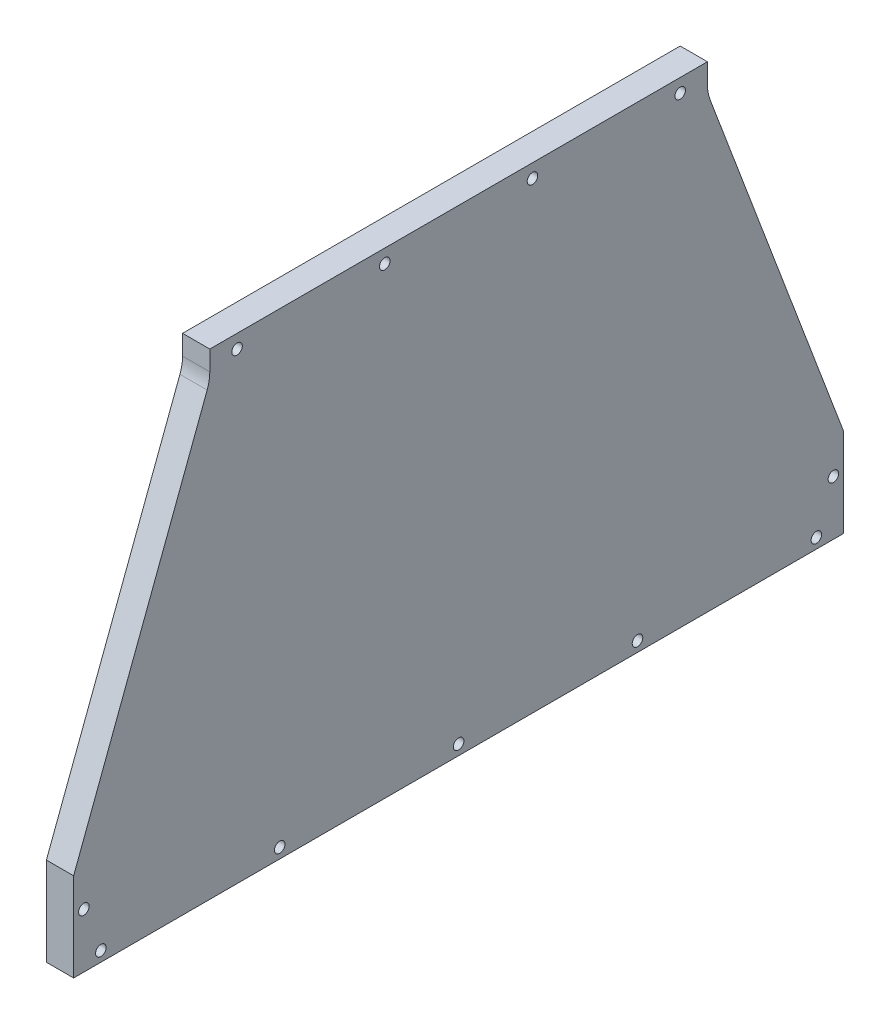
ISO-10303-21;
HEADER;
FILE_DESCRIPTION(('STEP AP214'),'2;1');
FILE_NAME('part.step','',(''),(''),'','','');
FILE_SCHEMA(('AUTOMOTIVE_DESIGN { 1 0 10303 214 1 1 1 1 }'));
ENDSEC;
DATA;
#1=APPLICATION_CONTEXT('core data for automotive mechanical design processes');
#2=APPLICATION_PROTOCOL_DEFINITION('international standard','automotive_design',2000,#1);
#3=PRODUCT_CONTEXT('',#1,'mechanical');
#4=PRODUCT('Part','Part','',(#3));
#5=PRODUCT_RELATED_PRODUCT_CATEGORY('part','',(#4));
#6=PRODUCT_DEFINITION_FORMATION('','',#4);
#7=PRODUCT_DEFINITION_CONTEXT('part definition',#1,'design');
#8=PRODUCT_DEFINITION('design','',#6,#7);
#9=PRODUCT_DEFINITION_SHAPE('','',#8);
#10=(LENGTH_UNIT() NAMED_UNIT(*) SI_UNIT(.MILLI.,.METRE.));
#11=(NAMED_UNIT(*) PLANE_ANGLE_UNIT() SI_UNIT($,.RADIAN.));
#12=(NAMED_UNIT(*) SI_UNIT($,.STERADIAN.) SOLID_ANGLE_UNIT());
#13=UNCERTAINTY_MEASURE_WITH_UNIT(LENGTH_MEASURE(1.E-05),#10,'distance_accuracy_value','');
#14=(GEOMETRIC_REPRESENTATION_CONTEXT(3) GLOBAL_UNCERTAINTY_ASSIGNED_CONTEXT((#13)) GLOBAL_UNIT_ASSIGNED_CONTEXT((#10,
#11,#12)) REPRESENTATION_CONTEXT('',''));
#15=CARTESIAN_POINT('',(0.,0.,0.));
#16=DIRECTION('',(0.,0.,1.));
#17=DIRECTION('',(1.,0.,0.));
#18=AXIS2_PLACEMENT_3D('',#15,#16,#17);
#19=CARTESIAN_POINT('',(-165.09999933097,-30.525,179.525));
#20=DIRECTION('',(0.,1.,0.));
#21=DIRECTION('',(0.,0.,1.));
#22=AXIS2_PLACEMENT_3D('',#19,#20,#21);
#23=PLANE('',#22);
#24=DIRECTION('',(0.,0.,1.));
#25=VECTOR('',#24,1.);
#26=CARTESIAN_POINT('',(-152.39999933097,-30.525,179.525));
#27=LINE('',#26,#25);
#28=CARTESIAN_POINT('',(-152.39999933097,-30.525,-179.525));
#29=VERTEX_POINT('',#28);
#30=CARTESIAN_POINT('',(-152.39999933097,-30.525,179.525));
#31=VERTEX_POINT('',#30);
#32=EDGE_CURVE('E140',#29,#31,#27,.T.);
#33=ORIENTED_EDGE('',*,*,#32,.T.);
#34=DIRECTION('',(1.,0.,0.));
#35=VECTOR('',#34,1.);
#36=CARTESIAN_POINT('',(-165.09999933097,-30.525,179.525));
#37=LINE('',#36,#35);
#38=CARTESIAN_POINT('',(-165.09999933097,-30.525,179.525));
#39=VERTEX_POINT('',#38);
#40=EDGE_CURVE('E122',#39,#31,#37,.T.);
#41=ORIENTED_EDGE('',*,*,#40,.F.);
#42=DIRECTION('',(0.,0.,1.));
#43=VECTOR('',#42,1.);
#44=CARTESIAN_POINT('',(-165.09999933097,-30.525,179.525));
#45=LINE('',#44,#43);
#46=CARTESIAN_POINT('',(-165.09999933097,-30.525,-179.525));
#47=VERTEX_POINT('',#46);
#48=EDGE_CURVE('E128',#47,#39,#45,.T.);
#49=ORIENTED_EDGE('',*,*,#48,.F.);
#50=DIRECTION('',(1.,0.,0.));
#51=VECTOR('',#50,1.);
#52=CARTESIAN_POINT('',(-165.09999933097,-30.525,-179.525));
#53=LINE('',#52,#51);
#54=EDGE_CURVE('E195',#47,#29,#53,.T.);
#55=ORIENTED_EDGE('',*,*,#54,.T.);
#56=EDGE_LOOP('',(#33,#41,#49,#55));
#57=FACE_BOUND('',#56,.T.);
#58=ADVANCED_FACE('F41',(#57),#23,.F.);
#59=CARTESIAN_POINT('',(-165.09999933097,-30.525,179.525));
#60=DIRECTION('',(0.,0.,-1.));
#61=DIRECTION('',(-1.,0.,0.));
#62=AXIS2_PLACEMENT_3D('',#59,#60,#61);
#63=PLANE('',#62);
#64=DIRECTION('',(0.,1.,0.));
#65=VECTOR('',#64,1.);
#66=CARTESIAN_POINT('',(-152.39999933097,-30.525,179.525));
#67=LINE('',#66,#65);
#68=CARTESIAN_POINT('',(-152.39999933097,10.75,179.525));
#69=VERTEX_POINT('',#68);
#70=EDGE_CURVE('E207',#31,#69,#67,.T.);
#71=ORIENTED_EDGE('',*,*,#70,.T.);
#72=DIRECTION('',(1.,0.,0.));
#73=VECTOR('',#72,1.);
#74=CARTESIAN_POINT('',(-165.09999933097,10.75,179.525));
#75=LINE('',#74,#73);
#76=CARTESIAN_POINT('',(-165.09999933097,10.75,179.525));
#77=VERTEX_POINT('',#76);
#78=EDGE_CURVE('E125',#77,#69,#75,.T.);
#79=ORIENTED_EDGE('',*,*,#78,.F.);
#80=DIRECTION('',(0.,1.,0.));
#81=VECTOR('',#80,1.);
#82=CARTESIAN_POINT('',(-165.09999933097,-30.525,179.525));
#83=LINE('',#82,#81);
#84=EDGE_CURVE('E118',#39,#77,#83,.T.);
#85=ORIENTED_EDGE('',*,*,#84,.F.);
#86=ORIENTED_EDGE('',*,*,#40,.T.);
#87=EDGE_LOOP('',(#71,#79,#85,#86));
#88=FACE_BOUND('',#87,.T.);
#89=ADVANCED_FACE('F120',(#88),#63,.F.);
#90=CARTESIAN_POINT('',(-165.09999933097,10.75,179.525));
#91=DIRECTION('',(0.,-0.353057252434242,-0.935601718950742));
#92=DIRECTION('',(0.,0.935601718950742,-0.353057252434242));
#93=AXIS2_PLACEMENT_3D('',#90,#91,#92);
#94=PLANE('',#93);
#95=DIRECTION('',(0.,0.935601718950742,-0.353057252434242));
#96=VECTOR('',#95,1.);
#97=CARTESIAN_POINT('',(-152.39999933097,10.75,179.525));
#98=LINE('',#97,#96);
#99=CARTESIAN_POINT('',(-152.39999933097,175.774013776931,117.251787253988));
#100=VERTEX_POINT('',#99);
#101=EDGE_CURVE('E206',#69,#100,#98,.T.);
#102=ORIENTED_EDGE('',*,*,#101,.T.);
#103=DIRECTION('',(1.,0.,0.));
#104=VECTOR('',#103,1.);
#105=CARTESIAN_POINT('',(-165.09999933097,175.774013776931,117.251787253988));
#106=LINE('',#105,#104);
#107=CARTESIAN_POINT('',(-165.09999933097,175.774013776931,117.251787253988));
#108=VERTEX_POINT('',#107);
#109=EDGE_CURVE('E56',#100,#108,#106,.F.);
#110=ORIENTED_EDGE('',*,*,#109,.T.);
#111=DIRECTION('',(0.,0.935601718950742,-0.353057252434242));
#112=VECTOR('',#111,1.);
#113=CARTESIAN_POINT('',(-165.09999933097,10.75,179.525));
#114=LINE('',#113,#112);
#115=EDGE_CURVE('E127',#77,#108,#114,.T.);
#116=ORIENTED_EDGE('',*,*,#115,.F.);
#117=ORIENTED_EDGE('',*,*,#78,.T.);
#118=EDGE_LOOP('',(#102,#110,#116,#117));
#119=FACE_BOUND('',#118,.T.);
#120=ADVANCED_FACE('F331',(#119),#94,.F.);
#121=CARTESIAN_POINT('',(-165.09999933097,191.725,116.025));
#122=DIRECTION('',(0.,0.,-1.));
#123=DIRECTION('',(-1.,0.,0.));
#124=AXIS2_PLACEMENT_3D('',#121,#122,#123);
#125=PLANE('',#124);
#126=DIRECTION('',(0.,1.,0.));
#127=VECTOR('',#126,1.);
#128=CARTESIAN_POINT('',(-165.09999933097,191.725,116.025));
#129=LINE('',#128,#127);
#130=CARTESIAN_POINT('',(-165.09999933097,182.499754435803,116.025));
#131=VERTEX_POINT('',#130);
#132=CARTESIAN_POINT('',(-165.09999933097,191.725,116.025));
#133=VERTEX_POINT('',#132);
#134=EDGE_CURVE('E216',#131,#133,#129,.T.);
#135=ORIENTED_EDGE('',*,*,#134,.F.);
#136=DIRECTION('',(1.,0.,0.));
#137=VECTOR('',#136,1.);
#138=CARTESIAN_POINT('',(-152.39999933097,182.499754435803,116.025));
#139=LINE('',#138,#137);
#140=CARTESIAN_POINT('',(-152.39999933097,182.499754435803,116.025));
#141=VERTEX_POINT('',#140);
#142=EDGE_CURVE('E151',#131,#141,#139,.T.);
#143=ORIENTED_EDGE('',*,*,#142,.T.);
#144=DIRECTION('',(0.,1.,0.));
#145=VECTOR('',#144,1.);
#146=CARTESIAN_POINT('',(-152.39999933097,191.725,116.025));
#147=LINE('',#146,#145);
#148=CARTESIAN_POINT('',(-152.39999933097,191.725,116.025));
#149=VERTEX_POINT('',#148);
#150=EDGE_CURVE('E190',#141,#149,#147,.T.);
#151=ORIENTED_EDGE('',*,*,#150,.T.);
#152=DIRECTION('',(1.,0.,0.));
#153=VECTOR('',#152,1.);
#154=CARTESIAN_POINT('',(-165.09999933097,191.725,116.025));
#155=LINE('',#154,#153);
#156=EDGE_CURVE('E146',#133,#149,#155,.T.);
#157=ORIENTED_EDGE('',*,*,#156,.F.);
#158=EDGE_LOOP('',(#135,#143,#151,#157));
#159=FACE_BOUND('',#158,.T.);
#160=ADVANCED_FACE('F352',(#159),#125,.F.);
#161=CARTESIAN_POINT('',(-165.09999933097,191.725,-116.025));
#162=DIRECTION('',(0.,-1.,0.));
#163=DIRECTION('',(0.,0.,-1.));
#164=AXIS2_PLACEMENT_3D('',#161,#162,#163);
#165=PLANE('',#164);
#166=DIRECTION('',(0.,0.,-1.));
#167=VECTOR('',#166,1.);
#168=CARTESIAN_POINT('',(-152.39999933097,191.725,-116.025));
#169=LINE('',#168,#167);
#170=CARTESIAN_POINT('',(-152.39999933097,191.725,-116.025));
#171=VERTEX_POINT('',#170);
#172=EDGE_CURVE('E187',#149,#171,#169,.T.);
#173=ORIENTED_EDGE('',*,*,#172,.T.);
#174=DIRECTION('',(1.,0.,0.));
#175=VECTOR('',#174,1.);
#176=CARTESIAN_POINT('',(-165.09999933097,191.725,-116.025));
#177=LINE('',#176,#175);
#178=CARTESIAN_POINT('',(-165.09999933097,191.725,-116.025));
#179=VERTEX_POINT('',#178);
#180=EDGE_CURVE('E186',#179,#171,#177,.T.);
#181=ORIENTED_EDGE('',*,*,#180,.F.);
#182=DIRECTION('',(0.,0.,-1.));
#183=VECTOR('',#182,1.);
#184=CARTESIAN_POINT('',(-165.09999933097,191.725,-116.025));
#185=LINE('',#184,#183);
#186=EDGE_CURVE('E203',#133,#179,#185,.T.);
#187=ORIENTED_EDGE('',*,*,#186,.F.);
#188=ORIENTED_EDGE('',*,*,#156,.T.);
#189=EDGE_LOOP('',(#173,#181,#187,#188));
#190=FACE_BOUND('',#189,.T.);
#191=ADVANCED_FACE('F202',(#190),#165,.F.);
#192=CARTESIAN_POINT('',(-165.09999933097,179.025,-116.025));
#193=DIRECTION('',(0.,0.,1.));
#194=DIRECTION('',(1.,0.,0.));
#195=AXIS2_PLACEMENT_3D('',#192,#193,#194);
#196=PLANE('',#195);
#197=DIRECTION('',(0.,-1.,0.));
#198=VECTOR('',#197,1.);
#199=CARTESIAN_POINT('',(-152.39999933097,179.025,-116.025));
#200=LINE('',#199,#198);
#201=CARTESIAN_POINT('',(-152.39999933097,182.499754435803,-116.025));
#202=VERTEX_POINT('',#201);
#203=EDGE_CURVE('E179',#171,#202,#200,.T.);
#204=ORIENTED_EDGE('',*,*,#203,.T.);
#205=DIRECTION('',(1.,0.,0.));
#206=VECTOR('',#205,1.);
#207=CARTESIAN_POINT('',(-165.09999933097,182.499754435803,-116.025));
#208=LINE('',#207,#206);
#209=CARTESIAN_POINT('',(-165.09999933097,182.499754435803,-116.025));
#210=VERTEX_POINT('',#209);
#211=EDGE_CURVE('E144',#202,#210,#208,.F.);
#212=ORIENTED_EDGE('',*,*,#211,.T.);
#213=DIRECTION('',(0.,-1.,0.));
#214=VECTOR('',#213,1.);
#215=CARTESIAN_POINT('',(-165.09999933097,179.025,-116.025));
#216=LINE('',#215,#214);
#217=EDGE_CURVE('E164',#179,#210,#216,.T.);
#218=ORIENTED_EDGE('',*,*,#217,.F.);
#219=ORIENTED_EDGE('',*,*,#180,.T.);
#220=EDGE_LOOP('',(#204,#212,#218,#219));
#221=FACE_BOUND('',#220,.T.);
#222=ADVANCED_FACE('F184',(#221),#196,.F.);
#223=CARTESIAN_POINT('',(-165.09999933097,179.025,-116.025));
#224=DIRECTION('',(0.,-0.353057252434243,0.935601718950742));
#225=DIRECTION('',(0.,-0.935601718950742,-0.353057252434243));
#226=AXIS2_PLACEMENT_3D('',#223,#224,#225);
#227=PLANE('',#226);
#228=DIRECTION('',(0.,-0.935601718950742,-0.353057252434243));
#229=VECTOR('',#228,1.);
#230=CARTESIAN_POINT('',(-165.09999933097,179.025,-116.025));
#231=LINE('',#230,#229);
#232=CARTESIAN_POINT('',(-165.09999933097,175.774013776931,-117.251787253988));
#233=VERTEX_POINT('',#232);
#234=CARTESIAN_POINT('',(-165.09999933097,10.75,-179.525));
#235=VERTEX_POINT('',#234);
#236=EDGE_CURVE('E161',#233,#235,#231,.T.);
#237=ORIENTED_EDGE('',*,*,#236,.F.);
#238=DIRECTION('',(1.,0.,0.));
#239=VECTOR('',#238,1.);
#240=CARTESIAN_POINT('',(-152.39999933097,175.774013776931,-117.251787253988));
#241=LINE('',#240,#239);
#242=CARTESIAN_POINT('',(-152.39999933097,175.774013776931,-117.251787253988));
#243=VERTEX_POINT('',#242);
#244=EDGE_CURVE('E141',#233,#243,#241,.T.);
#245=ORIENTED_EDGE('',*,*,#244,.T.);
#246=DIRECTION('',(0.,-0.935601718950742,-0.353057252434243));
#247=VECTOR('',#246,1.);
#248=CARTESIAN_POINT('',(-152.39999933097,179.025,-116.025));
#249=LINE('',#248,#247);
#250=CARTESIAN_POINT('',(-152.39999933097,10.75,-179.525));
#251=VERTEX_POINT('',#250);
#252=EDGE_CURVE('E181',#243,#251,#249,.T.);
#253=ORIENTED_EDGE('',*,*,#252,.T.);
#254=DIRECTION('',(1.,0.,0.));
#255=VECTOR('',#254,1.);
#256=CARTESIAN_POINT('',(-165.09999933097,10.75,-179.525));
#257=LINE('',#256,#255);
#258=EDGE_CURVE('E172',#235,#251,#257,.T.);
#259=ORIENTED_EDGE('',*,*,#258,.F.);
#260=EDGE_LOOP('',(#237,#245,#253,#259));
#261=FACE_BOUND('',#260,.T.);
#262=ADVANCED_FACE('F169',(#261),#227,.F.);
#263=CARTESIAN_POINT('',(-165.09999933097,-30.525,-179.525));
#264=DIRECTION('',(0.,0.,1.));
#265=DIRECTION('',(0.,-1.,0.));
#266=AXIS2_PLACEMENT_3D('',#263,#264,#265);
#267=PLANE('',#266);
#268=DIRECTION('',(0.,-1.,0.));
#269=VECTOR('',#268,1.);
#270=CARTESIAN_POINT('',(-152.39999933097,-30.525,-179.525));
#271=LINE('',#270,#269);
#272=EDGE_CURVE('E137',#251,#29,#271,.T.);
#273=ORIENTED_EDGE('',*,*,#272,.T.);
#274=ORIENTED_EDGE('',*,*,#54,.F.);
#275=DIRECTION('',(0.,-1.,0.));
#276=VECTOR('',#275,1.);
#277=CARTESIAN_POINT('',(-165.09999933097,-30.525,-179.525));
#278=LINE('',#277,#276);
#279=EDGE_CURVE('E133',#235,#47,#278,.T.);
#280=ORIENTED_EDGE('',*,*,#279,.F.);
#281=ORIENTED_EDGE('',*,*,#258,.T.);
#282=EDGE_LOOP('',(#273,#274,#280,#281));
#283=FACE_BOUND('',#282,.T.);
#284=ADVANCED_FACE('F289',(#283),#267,.F.);
#285=CARTESIAN_POINT('',(-165.09999933097,0.,0.));
#286=DIRECTION('',(1.,0.,0.));
#287=DIRECTION('',(0.,0.,-1.));
#288=AXIS2_PLACEMENT_3D('',#285,#286,#287);
#289=PLANE('',#288);
#290=CARTESIAN_POINT('',(-165.09999933097,185.375,-103.325));
#291=DIRECTION('',(-1.,0.,0.));
#292=DIRECTION('',(0.,0.,1.));
#293=AXIS2_PLACEMENT_3D('',#290,#291,#292);
#294=CIRCLE('',#293,2.45745);
#295=CARTESIAN_POINT('',(-165.09999933097,185.375,-100.86755));
#296=VERTEX_POINT('',#295);
#297=EDGE_CURVE('E281',#296,#296,#294,.T.);
#298=ORIENTED_EDGE('',*,*,#297,.F.);
#299=EDGE_LOOP('',(#298));
#300=FACE_BOUND('',#299,.T.);
#301=CARTESIAN_POINT('',(-165.09999933097,185.375,-34.4416666666666));
#302=DIRECTION('',(-1.,0.,0.));
#303=DIRECTION('',(0.,0.,1.));
#304=AXIS2_PLACEMENT_3D('',#301,#302,#303);
#305=CIRCLE('',#304,2.45745);
#306=CARTESIAN_POINT('',(-165.09999933097,185.375,-31.9842166666666));
#307=VERTEX_POINT('',#306);
#308=EDGE_CURVE('E275',#307,#307,#305,.T.);
#309=ORIENTED_EDGE('',*,*,#308,.F.);
#310=EDGE_LOOP('',(#309));
#311=FACE_BOUND('',#310,.T.);
#312=CARTESIAN_POINT('',(-165.09999933097,185.375,34.4416666666667));
#313=DIRECTION('',(-1.,0.,0.));
#314=DIRECTION('',(0.,0.,1.));
#315=AXIS2_PLACEMENT_3D('',#312,#313,#314);
#316=CIRCLE('',#315,2.45745);
#317=CARTESIAN_POINT('',(-165.09999933097,185.375,36.8991166666667));
#318=VERTEX_POINT('',#317);
#319=EDGE_CURVE('E269',#318,#318,#316,.T.);
#320=ORIENTED_EDGE('',*,*,#319,.F.);
#321=EDGE_LOOP('',(#320));
#322=FACE_BOUND('',#321,.T.);
#323=CARTESIAN_POINT('',(-165.09999933097,185.375,103.325));
#324=DIRECTION('',(-1.,0.,0.));
#325=DIRECTION('',(0.,0.,1.));
#326=AXIS2_PLACEMENT_3D('',#323,#324,#325);
#327=CIRCLE('',#326,2.45745);
#328=CARTESIAN_POINT('',(-165.09999933097,185.375,105.78245));
#329=VERTEX_POINT('',#328);
#330=EDGE_CURVE('E263',#329,#329,#327,.T.);
#331=ORIENTED_EDGE('',*,*,#330,.F.);
#332=EDGE_LOOP('',(#331));
#333=FACE_BOUND('',#332,.T.);
#334=CARTESIAN_POINT('',(-165.09999933097,-5.12499999999997,174.7625));
#335=DIRECTION('',(-1.,0.,0.));
#336=DIRECTION('',(0.,0.,1.));
#337=AXIS2_PLACEMENT_3D('',#334,#335,#336);
#338=CIRCLE('',#337,2.45745);
#339=CARTESIAN_POINT('',(-165.09999933097,-5.12499999999997,177.21995));
#340=VERTEX_POINT('',#339);
#341=EDGE_CURVE('E257',#340,#340,#338,.T.);
#342=ORIENTED_EDGE('',*,*,#341,.F.);
#343=EDGE_LOOP('',(#342));
#344=FACE_BOUND('',#343,.T.);
#345=CARTESIAN_POINT('',(-165.09999933097,-5.12499999999997,-174.7625));
#346=DIRECTION('',(-1.,0.,0.));
#347=DIRECTION('',(0.,0.,1.));
#348=AXIS2_PLACEMENT_3D('',#345,#346,#347);
#349=CIRCLE('',#348,2.45745);
#350=CARTESIAN_POINT('',(-165.09999933097,-5.12499999999997,-172.30505));
#351=VERTEX_POINT('',#350);
#352=EDGE_CURVE('E251',#351,#351,#349,.T.);
#353=ORIENTED_EDGE('',*,*,#352,.F.);
#354=EDGE_LOOP('',(#353));
#355=FACE_BOUND('',#354,.T.);
#356=CARTESIAN_POINT('',(-165.09999933097,-25.7625,-166.825));
#357=DIRECTION('',(-1.,0.,0.));
#358=DIRECTION('',(0.,0.,1.));
#359=AXIS2_PLACEMENT_3D('',#356,#357,#358);
#360=CIRCLE('',#359,2.45745);
#361=CARTESIAN_POINT('',(-165.09999933097,-25.7625,-164.36755));
#362=VERTEX_POINT('',#361);
#363=EDGE_CURVE('E245',#362,#362,#360,.T.);
#364=ORIENTED_EDGE('',*,*,#363,.F.);
#365=EDGE_LOOP('',(#364));
#366=FACE_BOUND('',#365,.T.);
#367=CARTESIAN_POINT('',(-165.09999933097,-25.7624999999999,166.825));
#368=DIRECTION('',(-1.,0.,0.));
#369=DIRECTION('',(0.,0.,1.));
#370=AXIS2_PLACEMENT_3D('',#367,#368,#369);
#371=CIRCLE('',#370,2.45745);
#372=CARTESIAN_POINT('',(-165.09999933097,-25.7624999999999,169.28245));
#373=VERTEX_POINT('',#372);
#374=EDGE_CURVE('E239',#373,#373,#371,.T.);
#375=ORIENTED_EDGE('',*,*,#374,.F.);
#376=EDGE_LOOP('',(#375));
#377=FACE_BOUND('',#376,.T.);
#378=CARTESIAN_POINT('',(-165.09999933097,-25.7625,0.));
#379=DIRECTION('',(-1.,0.,0.));
#380=DIRECTION('',(0.,0.,1.));
#381=AXIS2_PLACEMENT_3D('',#378,#379,#380);
#382=CIRCLE('',#381,2.45745);
#383=CARTESIAN_POINT('',(-165.09999933097,-25.7625,2.45744999999997));
#384=VERTEX_POINT('',#383);
#385=EDGE_CURVE('E233',#384,#384,#382,.T.);
#386=ORIENTED_EDGE('',*,*,#385,.F.);
#387=EDGE_LOOP('',(#386));
#388=FACE_BOUND('',#387,.T.);
#389=CARTESIAN_POINT('',(-165.09999933097,-25.7624999999999,83.4125));
#390=DIRECTION('',(-1.,0.,0.));
#391=DIRECTION('',(0.,0.,1.));
#392=AXIS2_PLACEMENT_3D('',#389,#390,#391);
#393=CIRCLE('',#392,2.45745);
#394=CARTESIAN_POINT('',(-165.09999933097,-25.7624999999999,85.86995));
#395=VERTEX_POINT('',#394);
#396=EDGE_CURVE('E227',#395,#395,#393,.T.);
#397=ORIENTED_EDGE('',*,*,#396,.F.);
#398=EDGE_LOOP('',(#397));
#399=FACE_BOUND('',#398,.T.);
#400=CARTESIAN_POINT('',(-165.09999933097,-25.7625,-83.4125));
#401=DIRECTION('',(-1.,0.,0.));
#402=DIRECTION('',(0.,0.,1.));
#403=AXIS2_PLACEMENT_3D('',#400,#401,#402);
#404=CIRCLE('',#403,2.45745);
#405=CARTESIAN_POINT('',(-165.09999933097,-25.7625,-80.95505));
#406=VERTEX_POINT('',#405);
#407=EDGE_CURVE('E221',#406,#406,#404,.T.);
#408=ORIENTED_EDGE('',*,*,#407,.F.);
#409=EDGE_LOOP('',(#408));
#410=FACE_BOUND('',#409,.T.);
#411=ORIENTED_EDGE('',*,*,#48,.T.);
#412=ORIENTED_EDGE('',*,*,#84,.T.);
#413=ORIENTED_EDGE('',*,*,#115,.T.);
#414=CARTESIAN_POINT('',(-165.09999933097,182.499754435803,135.075));
#415=DIRECTION('',(1.,0.,0.));
#416=DIRECTION('',(0.,0.,-1.));
#417=AXIS2_PLACEMENT_3D('',#414,#415,#416);
#418=CIRCLE('',#417,19.05);
#419=EDGE_CURVE('E11',#108,#131,#418,.T.);
#420=ORIENTED_EDGE('',*,*,#419,.T.);
#421=ORIENTED_EDGE('',*,*,#134,.T.);
#422=ORIENTED_EDGE('',*,*,#186,.T.);
#423=ORIENTED_EDGE('',*,*,#217,.T.);
#424=CARTESIAN_POINT('',(-165.09999933097,182.499754435803,-135.075));
#425=DIRECTION('',(1.,0.,0.));
#426=DIRECTION('',(0.,0.,-1.));
#427=AXIS2_PLACEMENT_3D('',#424,#425,#426);
#428=CIRCLE('',#427,19.05);
#429=EDGE_CURVE('E157',#210,#233,#428,.T.);
#430=ORIENTED_EDGE('',*,*,#429,.T.);
#431=ORIENTED_EDGE('',*,*,#236,.T.);
#432=ORIENTED_EDGE('',*,*,#279,.T.);
#433=EDGE_LOOP('',(#411,#412,#413,#420,#421,#422,#423,#430,#431,#432));
#434=FACE_BOUND('',#433,.T.);
#435=ADVANCED_FACE('F131',(#300,#311,#322,#333,#344,#355,#366,#377,#388,#399,#410,#434),#289,.F.);
#436=CARTESIAN_POINT('',(-152.39999933097,0.,0.));
#437=DIRECTION('',(1.,0.,0.));
#438=DIRECTION('',(0.,0.,-1.));
#439=AXIS2_PLACEMENT_3D('',#436,#437,#438);
#440=PLANE('',#439);
#441=CARTESIAN_POINT('',(-152.39999933097,185.375,-103.325));
#442=DIRECTION('',(-1.,0.,0.));
#443=DIRECTION('',(0.,0.,1.));
#444=AXIS2_PLACEMENT_3D('',#441,#442,#443);
#445=CIRCLE('',#444,2.45745);
#446=CARTESIAN_POINT('',(-152.39999933097,185.375,-100.86755));
#447=VERTEX_POINT('',#446);
#448=EDGE_CURVE('E278',#447,#447,#445,.T.);
#449=ORIENTED_EDGE('',*,*,#448,.T.);
#450=EDGE_LOOP('',(#449));
#451=FACE_BOUND('',#450,.T.);
#452=CARTESIAN_POINT('',(-152.39999933097,185.375,-34.4416666666666));
#453=DIRECTION('',(-1.,0.,0.));
#454=DIRECTION('',(0.,0.,1.));
#455=AXIS2_PLACEMENT_3D('',#452,#453,#454);
#456=CIRCLE('',#455,2.45745);
#457=CARTESIAN_POINT('',(-152.39999933097,185.375,-31.9842166666666));
#458=VERTEX_POINT('',#457);
#459=EDGE_CURVE('E272',#458,#458,#456,.T.);
#460=ORIENTED_EDGE('',*,*,#459,.T.);
#461=EDGE_LOOP('',(#460));
#462=FACE_BOUND('',#461,.T.);
#463=CARTESIAN_POINT('',(-152.39999933097,185.375,34.4416666666667));
#464=DIRECTION('',(-1.,0.,0.));
#465=DIRECTION('',(0.,0.,1.));
#466=AXIS2_PLACEMENT_3D('',#463,#464,#465);
#467=CIRCLE('',#466,2.45745);
#468=CARTESIAN_POINT('',(-152.39999933097,185.375,36.8991166666667));
#469=VERTEX_POINT('',#468);
#470=EDGE_CURVE('E266',#469,#469,#467,.T.);
#471=ORIENTED_EDGE('',*,*,#470,.T.);
#472=EDGE_LOOP('',(#471));
#473=FACE_BOUND('',#472,.T.);
#474=CARTESIAN_POINT('',(-152.39999933097,185.375,103.325));
#475=DIRECTION('',(-1.,0.,0.));
#476=DIRECTION('',(0.,0.,1.));
#477=AXIS2_PLACEMENT_3D('',#474,#475,#476);
#478=CIRCLE('',#477,2.45745);
#479=CARTESIAN_POINT('',(-152.39999933097,185.375,105.78245));
#480=VERTEX_POINT('',#479);
#481=EDGE_CURVE('E260',#480,#480,#478,.T.);
#482=ORIENTED_EDGE('',*,*,#481,.T.);
#483=EDGE_LOOP('',(#482));
#484=FACE_BOUND('',#483,.T.);
#485=CARTESIAN_POINT('',(-152.39999933097,-5.12499999999997,174.7625));
#486=DIRECTION('',(-1.,0.,0.));
#487=DIRECTION('',(0.,0.,1.));
#488=AXIS2_PLACEMENT_3D('',#485,#486,#487);
#489=CIRCLE('',#488,2.45745);
#490=CARTESIAN_POINT('',(-152.39999933097,-5.12499999999997,177.21995));
#491=VERTEX_POINT('',#490);
#492=EDGE_CURVE('E254',#491,#491,#489,.T.);
#493=ORIENTED_EDGE('',*,*,#492,.T.);
#494=EDGE_LOOP('',(#493));
#495=FACE_BOUND('',#494,.T.);
#496=CARTESIAN_POINT('',(-152.39999933097,-5.12499999999997,-174.7625));
#497=DIRECTION('',(-1.,0.,0.));
#498=DIRECTION('',(0.,0.,1.));
#499=AXIS2_PLACEMENT_3D('',#496,#497,#498);
#500=CIRCLE('',#499,2.45745);
#501=CARTESIAN_POINT('',(-152.39999933097,-5.12499999999997,-172.30505));
#502=VERTEX_POINT('',#501);
#503=EDGE_CURVE('E248',#502,#502,#500,.T.);
#504=ORIENTED_EDGE('',*,*,#503,.T.);
#505=EDGE_LOOP('',(#504));
#506=FACE_BOUND('',#505,.T.);
#507=CARTESIAN_POINT('',(-152.39999933097,-25.7625,-166.825));
#508=DIRECTION('',(-1.,0.,0.));
#509=DIRECTION('',(0.,0.,1.));
#510=AXIS2_PLACEMENT_3D('',#507,#508,#509);
#511=CIRCLE('',#510,2.45745);
#512=CARTESIAN_POINT('',(-152.39999933097,-25.7625,-164.36755));
#513=VERTEX_POINT('',#512);
#514=EDGE_CURVE('E242',#513,#513,#511,.T.);
#515=ORIENTED_EDGE('',*,*,#514,.T.);
#516=EDGE_LOOP('',(#515));
#517=FACE_BOUND('',#516,.T.);
#518=CARTESIAN_POINT('',(-152.39999933097,-25.7624999999999,166.825));
#519=DIRECTION('',(-1.,0.,0.));
#520=DIRECTION('',(0.,0.,1.));
#521=AXIS2_PLACEMENT_3D('',#518,#519,#520);
#522=CIRCLE('',#521,2.45745);
#523=CARTESIAN_POINT('',(-152.39999933097,-25.7624999999999,169.28245));
#524=VERTEX_POINT('',#523);
#525=EDGE_CURVE('E236',#524,#524,#522,.T.);
#526=ORIENTED_EDGE('',*,*,#525,.T.);
#527=EDGE_LOOP('',(#526));
#528=FACE_BOUND('',#527,.T.);
#529=CARTESIAN_POINT('',(-152.39999933097,-25.7625,0.));
#530=DIRECTION('',(-1.,0.,0.));
#531=DIRECTION('',(0.,0.,1.));
#532=AXIS2_PLACEMENT_3D('',#529,#530,#531);
#533=CIRCLE('',#532,2.45745);
#534=CARTESIAN_POINT('',(-152.39999933097,-25.7625,2.45744999999997));
#535=VERTEX_POINT('',#534);
#536=EDGE_CURVE('E230',#535,#535,#533,.T.);
#537=ORIENTED_EDGE('',*,*,#536,.T.);
#538=EDGE_LOOP('',(#537));
#539=FACE_BOUND('',#538,.T.);
#540=CARTESIAN_POINT('',(-152.39999933097,-25.7624999999999,83.4125));
#541=DIRECTION('',(-1.,0.,0.));
#542=DIRECTION('',(0.,0.,1.));
#543=AXIS2_PLACEMENT_3D('',#540,#541,#542);
#544=CIRCLE('',#543,2.45745);
#545=CARTESIAN_POINT('',(-152.39999933097,-25.7624999999999,85.86995));
#546=VERTEX_POINT('',#545);
#547=EDGE_CURVE('E224',#546,#546,#544,.T.);
#548=ORIENTED_EDGE('',*,*,#547,.T.);
#549=EDGE_LOOP('',(#548));
#550=FACE_BOUND('',#549,.T.);
#551=CARTESIAN_POINT('',(-152.39999933097,-25.7625,-83.4125));
#552=DIRECTION('',(-1.,0.,0.));
#553=DIRECTION('',(0.,0.,1.));
#554=AXIS2_PLACEMENT_3D('',#551,#552,#553);
#555=CIRCLE('',#554,2.45745);
#556=CARTESIAN_POINT('',(-152.39999933097,-25.7625,-80.95505));
#557=VERTEX_POINT('',#556);
#558=EDGE_CURVE('E212',#557,#557,#555,.T.);
#559=ORIENTED_EDGE('',*,*,#558,.T.);
#560=EDGE_LOOP('',(#559));
#561=FACE_BOUND('',#560,.T.);
#562=ORIENTED_EDGE('',*,*,#32,.F.);
#563=ORIENTED_EDGE('',*,*,#272,.F.);
#564=ORIENTED_EDGE('',*,*,#252,.F.);
#565=CARTESIAN_POINT('',(-152.39999933097,182.499754435803,-135.075));
#566=DIRECTION('',(1.,0.,0.));
#567=DIRECTION('',(0.,0.,-1.));
#568=AXIS2_PLACEMENT_3D('',#565,#566,#567);
#569=CIRCLE('',#568,19.05);
#570=EDGE_CURVE('E155',#243,#202,#569,.F.);
#571=ORIENTED_EDGE('',*,*,#570,.T.);
#572=ORIENTED_EDGE('',*,*,#203,.F.);
#573=ORIENTED_EDGE('',*,*,#172,.F.);
#574=ORIENTED_EDGE('',*,*,#150,.F.);
#575=CARTESIAN_POINT('',(-152.39999933097,182.499754435803,135.075));
#576=DIRECTION('',(1.,0.,0.));
#577=DIRECTION('',(0.,0.,-1.));
#578=AXIS2_PLACEMENT_3D('',#575,#576,#577);
#579=CIRCLE('',#578,19.05);
#580=EDGE_CURVE('E49',#141,#100,#579,.F.);
#581=ORIENTED_EDGE('',*,*,#580,.T.);
#582=ORIENTED_EDGE('',*,*,#101,.F.);
#583=ORIENTED_EDGE('',*,*,#70,.F.);
#584=EDGE_LOOP('',(#562,#563,#564,#571,#572,#573,#574,#581,#582,#583));
#585=FACE_BOUND('',#584,.T.);
#586=ADVANCED_FACE('F177',(#451,#462,#473,#484,#495,#506,#517,#528,#539,#550,#561,#585),#440,.T.);
#587=CARTESIAN_POINT('',(-165.09999933097,182.499754435803,-135.075));
#588=DIRECTION('',(-1.,0.,0.));
#589=DIRECTION('',(0.,0.,1.));
#590=AXIS2_PLACEMENT_3D('',#587,#588,#589);
#591=CYLINDRICAL_SURFACE('',#590,19.05);
#592=ORIENTED_EDGE('',*,*,#429,.F.);
#593=ORIENTED_EDGE('',*,*,#211,.F.);
#594=ORIENTED_EDGE('',*,*,#570,.F.);
#595=ORIENTED_EDGE('',*,*,#244,.F.);
#596=EDGE_LOOP('',(#592,#593,#594,#595));
#597=FACE_BOUND('',#596,.T.);
#598=ADVANCED_FACE('F174',(#597),#591,.F.);
#599=CARTESIAN_POINT('',(-165.09999933097,182.499754435803,135.075));
#600=DIRECTION('',(-1.,0.,0.));
#601=DIRECTION('',(0.,0.,1.));
#602=AXIS2_PLACEMENT_3D('',#599,#600,#601);
#603=CYLINDRICAL_SURFACE('',#602,19.05);
#604=ORIENTED_EDGE('',*,*,#419,.F.);
#605=ORIENTED_EDGE('',*,*,#109,.F.);
#606=ORIENTED_EDGE('',*,*,#580,.F.);
#607=ORIENTED_EDGE('',*,*,#142,.F.);
#608=EDGE_LOOP('',(#604,#605,#606,#607));
#609=FACE_BOUND('',#608,.T.);
#610=ADVANCED_FACE('F43',(#609),#603,.F.);
#611=CARTESIAN_POINT('',(-165.09999933097,-25.7625,-83.4125));
#612=DIRECTION('',(-1.,0.,0.));
#613=DIRECTION('',(0.,0.,1.));
#614=AXIS2_PLACEMENT_3D('',#611,#612,#613);
#615=CYLINDRICAL_SURFACE('',#614,2.45745);
#616=ORIENTED_EDGE('',*,*,#558,.F.);
#617=EDGE_LOOP('',(#616));
#618=FACE_BOUND('',#617,.T.);
#619=ORIENTED_EDGE('',*,*,#407,.T.);
#620=EDGE_LOOP('',(#619));
#621=FACE_BOUND('',#620,.T.);
#622=ADVANCED_FACE('F311',(#618,#621),#615,.F.);
#623=CARTESIAN_POINT('',(-165.09999933097,-25.7624999999999,83.4125));
#624=DIRECTION('',(-1.,0.,0.));
#625=DIRECTION('',(0.,0.,1.));
#626=AXIS2_PLACEMENT_3D('',#623,#624,#625);
#627=CYLINDRICAL_SURFACE('',#626,2.45745);
#628=ORIENTED_EDGE('',*,*,#547,.F.);
#629=EDGE_LOOP('',(#628));
#630=FACE_BOUND('',#629,.T.);
#631=ORIENTED_EDGE('',*,*,#396,.T.);
#632=EDGE_LOOP('',(#631));
#633=FACE_BOUND('',#632,.T.);
#634=ADVANCED_FACE('F313',(#630,#633),#627,.F.);
#635=CARTESIAN_POINT('',(-165.09999933097,-25.7625,0.));
#636=DIRECTION('',(-1.,0.,0.));
#637=DIRECTION('',(0.,0.,1.));
#638=AXIS2_PLACEMENT_3D('',#635,#636,#637);
#639=CYLINDRICAL_SURFACE('',#638,2.45745);
#640=ORIENTED_EDGE('',*,*,#536,.F.);
#641=EDGE_LOOP('',(#640));
#642=FACE_BOUND('',#641,.T.);
#643=ORIENTED_EDGE('',*,*,#385,.T.);
#644=EDGE_LOOP('',(#643));
#645=FACE_BOUND('',#644,.T.);
#646=ADVANCED_FACE('F320',(#642,#645),#639,.F.);
#647=CARTESIAN_POINT('',(-165.09999933097,-25.7624999999999,166.825));
#648=DIRECTION('',(-1.,0.,0.));
#649=DIRECTION('',(0.,0.,1.));
#650=AXIS2_PLACEMENT_3D('',#647,#648,#649);
#651=CYLINDRICAL_SURFACE('',#650,2.45745);
#652=ORIENTED_EDGE('',*,*,#525,.F.);
#653=EDGE_LOOP('',(#652));
#654=FACE_BOUND('',#653,.T.);
#655=ORIENTED_EDGE('',*,*,#374,.T.);
#656=EDGE_LOOP('',(#655));
#657=FACE_BOUND('',#656,.T.);
#658=ADVANCED_FACE('F422',(#654,#657),#651,.F.);
#659=CARTESIAN_POINT('',(-165.09999933097,-25.7625,-166.825));
#660=DIRECTION('',(-1.,0.,0.));
#661=DIRECTION('',(0.,0.,1.));
#662=AXIS2_PLACEMENT_3D('',#659,#660,#661);
#663=CYLINDRICAL_SURFACE('',#662,2.45745);
#664=ORIENTED_EDGE('',*,*,#514,.F.);
#665=EDGE_LOOP('',(#664));
#666=FACE_BOUND('',#665,.T.);
#667=ORIENTED_EDGE('',*,*,#363,.T.);
#668=EDGE_LOOP('',(#667));
#669=FACE_BOUND('',#668,.T.);
#670=ADVANCED_FACE('F432',(#666,#669),#663,.F.);
#671=CARTESIAN_POINT('',(-165.09999933097,-5.12499999999997,-174.7625));
#672=DIRECTION('',(-1.,0.,0.));
#673=DIRECTION('',(0.,0.,1.));
#674=AXIS2_PLACEMENT_3D('',#671,#672,#673);
#675=CYLINDRICAL_SURFACE('',#674,2.45745);
#676=ORIENTED_EDGE('',*,*,#503,.F.);
#677=EDGE_LOOP('',(#676));
#678=FACE_BOUND('',#677,.T.);
#679=ORIENTED_EDGE('',*,*,#352,.T.);
#680=EDGE_LOOP('',(#679));
#681=FACE_BOUND('',#680,.T.);
#682=ADVANCED_FACE('F442',(#678,#681),#675,.F.);
#683=CARTESIAN_POINT('',(-165.09999933097,-5.12499999999997,174.7625));
#684=DIRECTION('',(-1.,0.,0.));
#685=DIRECTION('',(0.,0.,1.));
#686=AXIS2_PLACEMENT_3D('',#683,#684,#685);
#687=CYLINDRICAL_SURFACE('',#686,2.45745);
#688=ORIENTED_EDGE('',*,*,#492,.F.);
#689=EDGE_LOOP('',(#688));
#690=FACE_BOUND('',#689,.T.);
#691=ORIENTED_EDGE('',*,*,#341,.T.);
#692=EDGE_LOOP('',(#691));
#693=FACE_BOUND('',#692,.T.);
#694=ADVANCED_FACE('F452',(#690,#693),#687,.F.);
#695=CARTESIAN_POINT('',(-165.09999933097,185.375,103.325));
#696=DIRECTION('',(-1.,0.,0.));
#697=DIRECTION('',(0.,0.,1.));
#698=AXIS2_PLACEMENT_3D('',#695,#696,#697);
#699=CYLINDRICAL_SURFACE('',#698,2.45745);
#700=ORIENTED_EDGE('',*,*,#481,.F.);
#701=EDGE_LOOP('',(#700));
#702=FACE_BOUND('',#701,.T.);
#703=ORIENTED_EDGE('',*,*,#330,.T.);
#704=EDGE_LOOP('',(#703));
#705=FACE_BOUND('',#704,.T.);
#706=ADVANCED_FACE('F462',(#702,#705),#699,.F.);
#707=CARTESIAN_POINT('',(-165.09999933097,185.375,34.4416666666667));
#708=DIRECTION('',(-1.,0.,0.));
#709=DIRECTION('',(0.,0.,1.));
#710=AXIS2_PLACEMENT_3D('',#707,#708,#709);
#711=CYLINDRICAL_SURFACE('',#710,2.45745);
#712=ORIENTED_EDGE('',*,*,#470,.F.);
#713=EDGE_LOOP('',(#712));
#714=FACE_BOUND('',#713,.T.);
#715=ORIENTED_EDGE('',*,*,#319,.T.);
#716=EDGE_LOOP('',(#715));
#717=FACE_BOUND('',#716,.T.);
#718=ADVANCED_FACE('F472',(#714,#717),#711,.F.);
#719=CARTESIAN_POINT('',(-165.09999933097,185.375,-34.4416666666666));
#720=DIRECTION('',(-1.,0.,0.));
#721=DIRECTION('',(0.,0.,1.));
#722=AXIS2_PLACEMENT_3D('',#719,#720,#721);
#723=CYLINDRICAL_SURFACE('',#722,2.45745);
#724=ORIENTED_EDGE('',*,*,#459,.F.);
#725=EDGE_LOOP('',(#724));
#726=FACE_BOUND('',#725,.T.);
#727=ORIENTED_EDGE('',*,*,#308,.T.);
#728=EDGE_LOOP('',(#727));
#729=FACE_BOUND('',#728,.T.);
#730=ADVANCED_FACE('F482',(#726,#729),#723,.F.);
#731=CARTESIAN_POINT('',(-165.09999933097,185.375,-103.325));
#732=DIRECTION('',(-1.,0.,0.));
#733=DIRECTION('',(0.,0.,1.));
#734=AXIS2_PLACEMENT_3D('',#731,#732,#733);
#735=CYLINDRICAL_SURFACE('',#734,2.45745);
#736=ORIENTED_EDGE('',*,*,#448,.F.);
#737=EDGE_LOOP('',(#736));
#738=FACE_BOUND('',#737,.T.);
#739=ORIENTED_EDGE('',*,*,#297,.T.);
#740=EDGE_LOOP('',(#739));
#741=FACE_BOUND('',#740,.T.);
#742=ADVANCED_FACE('F285',(#738,#741),#735,.F.);
#743=CLOSED_SHELL('',(#58,#89,#120,#160,#191,#222,#262,#284,#435,#586,#598,#610,#622,#634,#646,
#658,#670,#682,#694,#706,#718,#730,#742));
#744=MANIFOLD_SOLID_BREP('B2',#743);
#745=ADVANCED_BREP_SHAPE_REPRESENTATION('',(#18,#744),#14);
#746=SHAPE_DEFINITION_REPRESENTATION(#9,#745);
ENDSEC;
END-ISO-10303-21;
